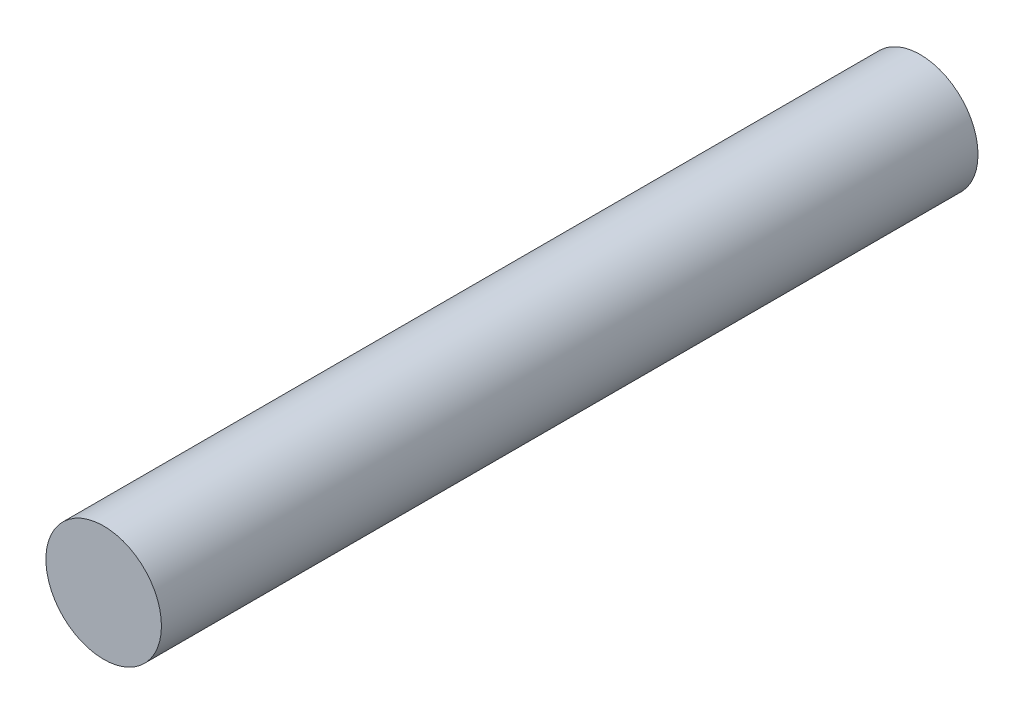
ISO-10303-21;
HEADER;
FILE_DESCRIPTION(('STEP AP214'),'2;1');
FILE_NAME('part.step','',(''),(''),'','','');
FILE_SCHEMA(('AUTOMOTIVE_DESIGN { 1 0 10303 214 1 1 1 1 }'));
ENDSEC;
DATA;
#1=APPLICATION_CONTEXT('core data for automotive mechanical design processes');
#2=APPLICATION_PROTOCOL_DEFINITION('international standard','automotive_design',2000,#1);
#3=PRODUCT_CONTEXT('',#1,'mechanical');
#4=PRODUCT('Part','Part','',(#3));
#5=PRODUCT_RELATED_PRODUCT_CATEGORY('part','',(#4));
#6=PRODUCT_DEFINITION_FORMATION('','',#4);
#7=PRODUCT_DEFINITION_CONTEXT('part definition',#1,'design');
#8=PRODUCT_DEFINITION('design','',#6,#7);
#9=PRODUCT_DEFINITION_SHAPE('','',#8);
#10=(LENGTH_UNIT() NAMED_UNIT(*) SI_UNIT(.MILLI.,.METRE.));
#11=(NAMED_UNIT(*) PLANE_ANGLE_UNIT() SI_UNIT($,.RADIAN.));
#12=(NAMED_UNIT(*) SI_UNIT($,.STERADIAN.) SOLID_ANGLE_UNIT());
#13=UNCERTAINTY_MEASURE_WITH_UNIT(LENGTH_MEASURE(1.E-05),#10,'distance_accuracy_value','');
#14=(GEOMETRIC_REPRESENTATION_CONTEXT(3) GLOBAL_UNCERTAINTY_ASSIGNED_CONTEXT((#13)) GLOBAL_UNIT_ASSIGNED_CONTEXT((#10,
#11,#12)) REPRESENTATION_CONTEXT('',''));
#15=CARTESIAN_POINT('',(0.,0.,0.));
#16=DIRECTION('',(0.,0.,1.));
#17=DIRECTION('',(1.,0.,0.));
#18=AXIS2_PLACEMENT_3D('',#15,#16,#17);
#19=CARTESIAN_POINT('',(0.,0.,53.));
#20=DIRECTION('',(0.,0.,-1.));
#21=DIRECTION('',(-1.,0.,0.));
#22=AXIS2_PLACEMENT_3D('',#19,#20,#21);
#23=CYLINDRICAL_SURFACE('',#22,7.5);
#24=CARTESIAN_POINT('',(0.,0.,53.));
#25=DIRECTION('',(0.,0.,1.));
#26=DIRECTION('',(1.,0.,0.));
#27=AXIS2_PLACEMENT_3D('',#24,#25,#26);
#28=CIRCLE('',#27,7.5);
#29=CARTESIAN_POINT('',(7.5,0.,53.));
#30=VERTEX_POINT('',#29);
#31=EDGE_CURVE('E10',#30,#30,#28,.T.);
#32=ORIENTED_EDGE('',*,*,#31,.F.);
#33=EDGE_LOOP('',(#32));
#34=FACE_BOUND('',#33,.T.);
#35=CARTESIAN_POINT('',(0.,0.,-53.));
#36=DIRECTION('',(0.,0.,1.));
#37=DIRECTION('',(1.,0.,0.));
#38=AXIS2_PLACEMENT_3D('',#35,#36,#37);
#39=CIRCLE('',#38,7.5);
#40=CARTESIAN_POINT('',(7.5,0.,-53.));
#41=VERTEX_POINT('',#40);
#42=EDGE_CURVE('E40',#41,#41,#39,.T.);
#43=ORIENTED_EDGE('',*,*,#42,.T.);
#44=EDGE_LOOP('',(#43));
#45=FACE_BOUND('',#44,.T.);
#46=ADVANCED_FACE('F37',(#34,#45),#23,.T.);
#47=CARTESIAN_POINT('',(0.,0.,53.));
#48=DIRECTION('',(0.,0.,1.));
#49=DIRECTION('',(1.,0.,0.));
#50=AXIS2_PLACEMENT_3D('',#47,#48,#49);
#51=PLANE('',#50);
#52=ORIENTED_EDGE('',*,*,#31,.T.);
#53=EDGE_LOOP('',(#52));
#54=FACE_BOUND('',#53,.T.);
#55=ADVANCED_FACE('F54',(#54),#51,.T.);
#56=CARTESIAN_POINT('',(0.,0.,-53.));
#57=DIRECTION('',(0.,0.,1.));
#58=DIRECTION('',(1.,0.,0.));
#59=AXIS2_PLACEMENT_3D('',#56,#57,#58);
#60=PLANE('',#59);
#61=ORIENTED_EDGE('',*,*,#42,.F.);
#62=EDGE_LOOP('',(#61));
#63=FACE_BOUND('',#62,.T.);
#64=ADVANCED_FACE('F52',(#63),#60,.F.);
#65=CLOSED_SHELL('',(#46,#55,#64));
#66=MANIFOLD_SOLID_BREP('B2',#65);
#67=ADVANCED_BREP_SHAPE_REPRESENTATION('',(#18,#66),#14);
#68=SHAPE_DEFINITION_REPRESENTATION(#9,#67);
ENDSEC;
END-ISO-10303-21;
